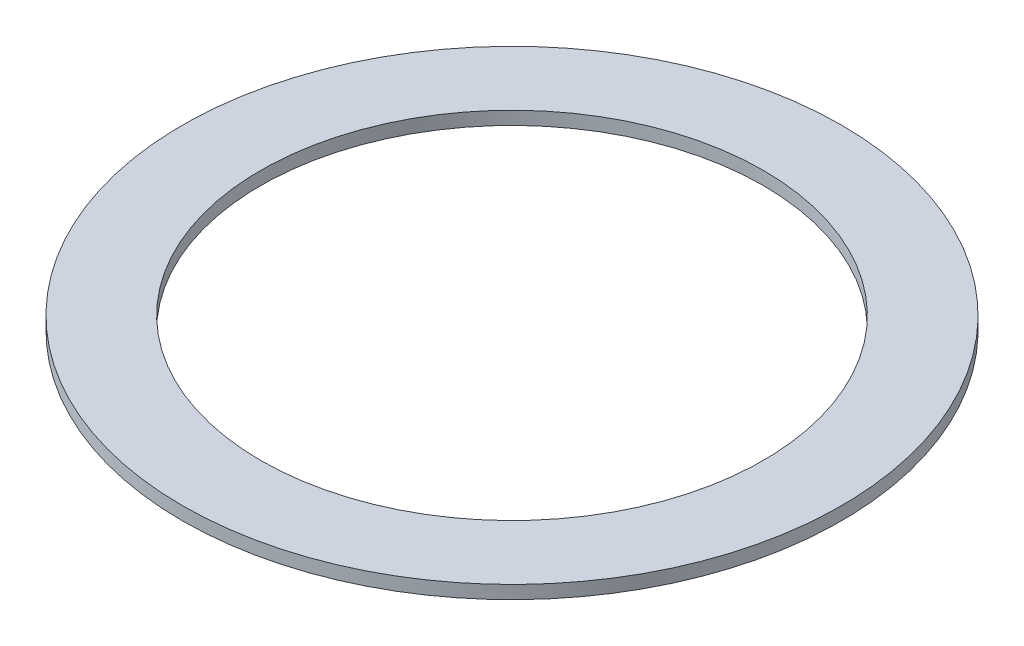
ISO-10303-21;
HEADER;
FILE_DESCRIPTION(('STEP AP214'),'2;1');
FILE_NAME('part.step','',(''),(''),'','','');
FILE_SCHEMA(('AUTOMOTIVE_DESIGN { 1 0 10303 214 1 1 1 1 }'));
ENDSEC;
DATA;
#1=APPLICATION_CONTEXT('core data for automotive mechanical design processes');
#2=APPLICATION_PROTOCOL_DEFINITION('international standard','automotive_design',2000,#1);
#3=PRODUCT_CONTEXT('',#1,'mechanical');
#4=PRODUCT('Part','Part','',(#3));
#5=PRODUCT_RELATED_PRODUCT_CATEGORY('part','',(#4));
#6=PRODUCT_DEFINITION_FORMATION('','',#4);
#7=PRODUCT_DEFINITION_CONTEXT('part definition',#1,'design');
#8=PRODUCT_DEFINITION('design','',#6,#7);
#9=PRODUCT_DEFINITION_SHAPE('','',#8);
#10=(LENGTH_UNIT() NAMED_UNIT(*) SI_UNIT(.MILLI.,.METRE.));
#11=(NAMED_UNIT(*) PLANE_ANGLE_UNIT() SI_UNIT($,.RADIAN.));
#12=(NAMED_UNIT(*) SI_UNIT($,.STERADIAN.) SOLID_ANGLE_UNIT());
#13=UNCERTAINTY_MEASURE_WITH_UNIT(LENGTH_MEASURE(1.E-05),#10,'distance_accuracy_value','');
#14=(GEOMETRIC_REPRESENTATION_CONTEXT(3) GLOBAL_UNCERTAINTY_ASSIGNED_CONTEXT((#13)) GLOBAL_UNIT_ASSIGNED_CONTEXT((#10,
#11,#12)) REPRESENTATION_CONTEXT('',''));
#15=CARTESIAN_POINT('',(0.,0.,0.));
#16=DIRECTION('',(0.,0.,1.));
#17=DIRECTION('',(1.,0.,0.));
#18=AXIS2_PLACEMENT_3D('',#15,#16,#17);
#19=CARTESIAN_POINT('',(0.,0.4,0.));
#20=DIRECTION('',(0.,1.,0.));
#21=DIRECTION('',(0.,0.,1.));
#22=AXIS2_PLACEMENT_3D('',#19,#20,#21);
#23=PLANE('',#22);
#24=CARTESIAN_POINT('',(0.,0.4,0.));
#25=DIRECTION('',(0.,1.,0.));
#26=DIRECTION('',(0.,0.,1.));
#27=AXIS2_PLACEMENT_3D('',#24,#25,#26);
#28=CIRCLE('',#27,10.);
#29=CARTESIAN_POINT('',(0.,0.4,10.));
#30=VERTEX_POINT('',#29);
#31=EDGE_CURVE('E10',#30,#30,#28,.T.);
#32=ORIENTED_EDGE('',*,*,#31,.T.);
#33=EDGE_LOOP('',(#32));
#34=FACE_BOUND('',#33,.T.);
#35=CARTESIAN_POINT('',(0.,0.4,0.));
#36=DIRECTION('',(0.,1.,0.));
#37=DIRECTION('',(0.,0.,1.));
#38=AXIS2_PLACEMENT_3D('',#35,#36,#37);
#39=CIRCLE('',#38,7.625);
#40=CARTESIAN_POINT('',(0.,0.4,7.625));
#41=VERTEX_POINT('',#40);
#42=EDGE_CURVE('E50',#41,#41,#39,.T.);
#43=ORIENTED_EDGE('',*,*,#42,.F.);
#44=EDGE_LOOP('',(#43));
#45=FACE_BOUND('',#44,.T.);
#46=ADVANCED_FACE('F39',(#34,#45),#23,.T.);
#47=CARTESIAN_POINT('',(0.,0.,0.));
#48=DIRECTION('',(0.,1.,0.));
#49=DIRECTION('',(0.,0.,1.));
#50=AXIS2_PLACEMENT_3D('',#47,#48,#49);
#51=PLANE('',#50);
#52=CARTESIAN_POINT('',(0.,0.,0.));
#53=DIRECTION('',(0.,1.,0.));
#54=DIRECTION('',(0.,0.,1.));
#55=AXIS2_PLACEMENT_3D('',#52,#53,#54);
#56=CIRCLE('',#55,10.);
#57=CARTESIAN_POINT('',(0.,0.,10.));
#58=VERTEX_POINT('',#57);
#59=EDGE_CURVE('E43',#58,#58,#56,.T.);
#60=ORIENTED_EDGE('',*,*,#59,.F.);
#61=EDGE_LOOP('',(#60));
#62=FACE_BOUND('',#61,.T.);
#63=CARTESIAN_POINT('',(0.,0.,0.));
#64=DIRECTION('',(0.,1.,0.));
#65=DIRECTION('',(0.,0.,1.));
#66=AXIS2_PLACEMENT_3D('',#63,#64,#65);
#67=CIRCLE('',#66,7.625);
#68=CARTESIAN_POINT('',(0.,0.,7.625));
#69=VERTEX_POINT('',#68);
#70=EDGE_CURVE('E52',#69,#69,#67,.T.);
#71=ORIENTED_EDGE('',*,*,#70,.T.);
#72=EDGE_LOOP('',(#71));
#73=FACE_BOUND('',#72,.T.);
#74=ADVANCED_FACE('F62',(#62,#73),#51,.F.);
#75=CARTESIAN_POINT('',(0.,0.4,0.));
#76=DIRECTION('',(0.,-1.,0.));
#77=DIRECTION('',(0.,0.,-1.));
#78=AXIS2_PLACEMENT_3D('',#75,#76,#77);
#79=CYLINDRICAL_SURFACE('',#78,10.);
#80=ORIENTED_EDGE('',*,*,#31,.F.);
#81=EDGE_LOOP('',(#80));
#82=FACE_BOUND('',#81,.T.);
#83=ORIENTED_EDGE('',*,*,#59,.T.);
#84=EDGE_LOOP('',(#83));
#85=FACE_BOUND('',#84,.T.);
#86=ADVANCED_FACE('F41',(#82,#85),#79,.T.);
#87=CARTESIAN_POINT('',(0.,0.4,0.));
#88=DIRECTION('',(0.,-1.,0.));
#89=DIRECTION('',(0.,0.,-1.));
#90=AXIS2_PLACEMENT_3D('',#87,#88,#89);
#91=CYLINDRICAL_SURFACE('',#90,7.625);
#92=ORIENTED_EDGE('',*,*,#42,.T.);
#93=EDGE_LOOP('',(#92));
#94=FACE_BOUND('',#93,.T.);
#95=ORIENTED_EDGE('',*,*,#70,.F.);
#96=EDGE_LOOP('',(#95));
#97=FACE_BOUND('',#96,.T.);
#98=ADVANCED_FACE('F58',(#94,#97),#91,.F.);
#99=CLOSED_SHELL('',(#46,#74,#86,#98));
#100=MANIFOLD_SOLID_BREP('B2',#99);
#101=ADVANCED_BREP_SHAPE_REPRESENTATION('',(#18,#100),#14);
#102=SHAPE_DEFINITION_REPRESENTATION(#9,#101);
ENDSEC;
END-ISO-10303-21;
